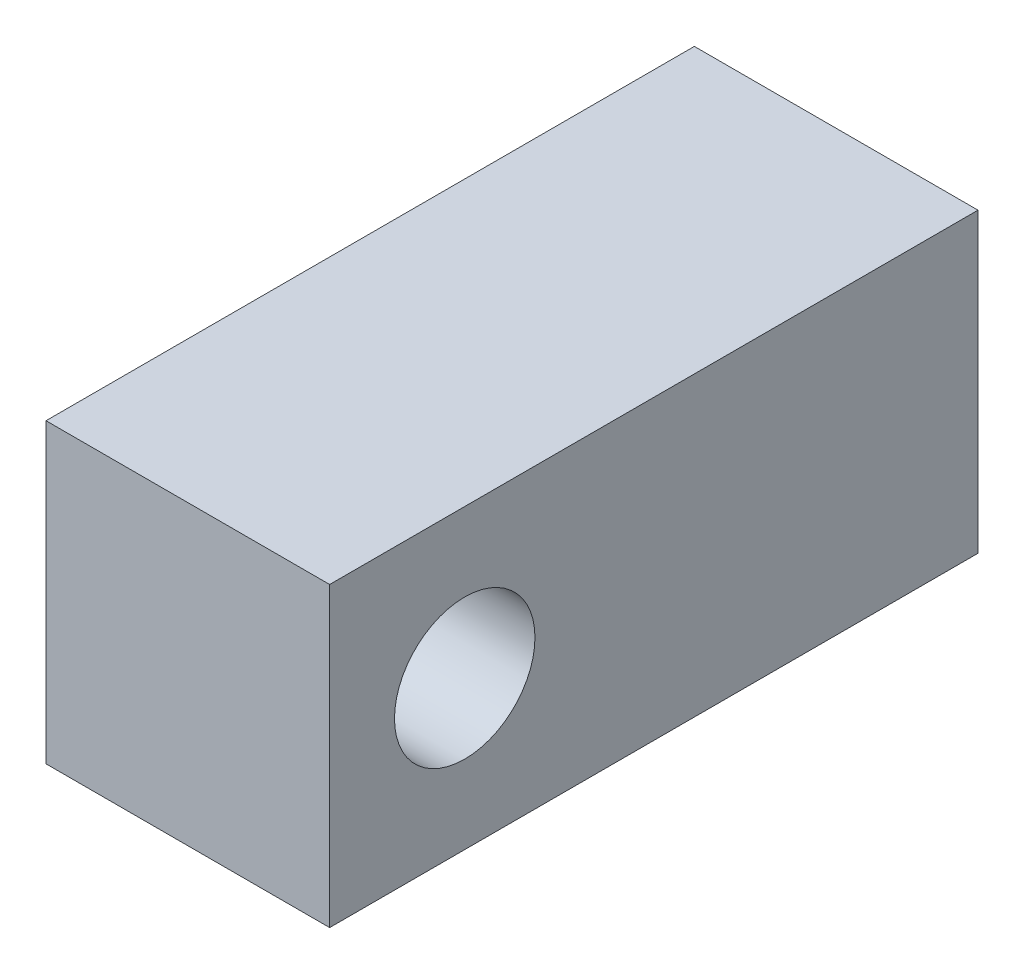
ISO-10303-21;
HEADER;
FILE_DESCRIPTION(('STEP AP214'),'2;1');
FILE_NAME('part.step','',(''),(''),'','','');
FILE_SCHEMA(('AUTOMOTIVE_DESIGN { 1 0 10303 214 1 1 1 1 }'));
ENDSEC;
DATA;
#1=APPLICATION_CONTEXT('core data for automotive mechanical design processes');
#2=APPLICATION_PROTOCOL_DEFINITION('international standard','automotive_design',2000,#1);
#3=PRODUCT_CONTEXT('',#1,'mechanical');
#4=PRODUCT('Part','Part','',(#3));
#5=PRODUCT_RELATED_PRODUCT_CATEGORY('part','',(#4));
#6=PRODUCT_DEFINITION_FORMATION('','',#4);
#7=PRODUCT_DEFINITION_CONTEXT('part definition',#1,'design');
#8=PRODUCT_DEFINITION('design','',#6,#7);
#9=PRODUCT_DEFINITION_SHAPE('','',#8);
#10=(LENGTH_UNIT() NAMED_UNIT(*) SI_UNIT(.MILLI.,.METRE.));
#11=(NAMED_UNIT(*) PLANE_ANGLE_UNIT() SI_UNIT($,.RADIAN.));
#12=(NAMED_UNIT(*) SI_UNIT($,.STERADIAN.) SOLID_ANGLE_UNIT());
#13=UNCERTAINTY_MEASURE_WITH_UNIT(LENGTH_MEASURE(1.E-05),#10,'distance_accuracy_value','');
#14=(GEOMETRIC_REPRESENTATION_CONTEXT(3) GLOBAL_UNCERTAINTY_ASSIGNED_CONTEXT((#13)) GLOBAL_UNIT_ASSIGNED_CONTEXT((#10,
#11,#12)) REPRESENTATION_CONTEXT('',''));
#15=CARTESIAN_POINT('',(0.,0.,0.));
#16=DIRECTION('',(0.,0.,1.));
#17=DIRECTION('',(1.,0.,0.));
#18=AXIS2_PLACEMENT_3D('',#15,#16,#17);
#19=CARTESIAN_POINT('',(37.1122382547684,65.0424365132959,14.9999998733401));
#20=DIRECTION('',(-1.,0.,0.));
#21=DIRECTION('',(0.,0.,-1.));
#22=AXIS2_PLACEMENT_3D('',#19,#20,#21);
#23=PLANE('',#22);
#24=DIRECTION('',(0.,-1.,0.));
#25=VECTOR('',#24,1.);
#26=CARTESIAN_POINT('',(37.1122382547684,71.2424366027028,39.7000002384186));
#27=LINE('',#26,#25);
#28=CARTESIAN_POINT('',(37.1122382547684,71.2424366027028,39.7000002384186));
#29=VERTEX_POINT('',#28);
#30=CARTESIAN_POINT('',(37.1122382547684,58.8424364238889,39.7000002384186));
#31=VERTEX_POINT('',#30);
#32=EDGE_CURVE('E152',#29,#31,#27,.T.);
#33=ORIENTED_EDGE('',*,*,#32,.T.);
#34=DIRECTION('',(0.,0.,-1.));
#35=VECTOR('',#34,1.);
#36=CARTESIAN_POINT('',(37.1122382547684,58.8424364238889,39.7000002384186));
#37=LINE('',#36,#35);
#38=CARTESIAN_POINT('',(37.1122382547684,58.8424364238889,17.299999910593));
#39=VERTEX_POINT('',#38);
#40=EDGE_CURVE('E129',#31,#39,#37,.T.);
#41=ORIENTED_EDGE('',*,*,#40,.T.);
#42=DIRECTION('',(0.,1.,0.));
#43=VECTOR('',#42,1.);
#44=CARTESIAN_POINT('',(37.1122382547684,71.2424366027028,17.299999910593));
#45=LINE('',#44,#43);
#46=CARTESIAN_POINT('',(37.1122382547684,71.2424366027028,17.299999910593));
#47=VERTEX_POINT('',#46);
#48=EDGE_CURVE('E155',#39,#47,#45,.T.);
#49=ORIENTED_EDGE('',*,*,#48,.T.);
#50=DIRECTION('',(0.,0.,1.));
#51=VECTOR('',#50,1.);
#52=CARTESIAN_POINT('',(37.1122382547684,71.2424366027028,39.7000002384186));
#53=LINE('',#52,#51);
#54=EDGE_CURVE('E140',#47,#29,#53,.T.);
#55=ORIENTED_EDGE('',*,*,#54,.T.);
#56=EDGE_LOOP('',(#33,#41,#49,#55));
#57=FACE_BOUND('',#56,.T.);
#58=CARTESIAN_POINT('',(37.1122382547684,65.0424365132959,50.5));
#59=DIRECTION('',(1.,0.,0.));
#60=DIRECTION('',(0.,-1.,0.));
#61=AXIS2_PLACEMENT_3D('',#58,#59,#60);
#62=CIRCLE('',#61,5.2);
#63=CARTESIAN_POINT('',(37.1122382547684,59.8424365132959,50.5));
#64=VERTEX_POINT('',#63);
#65=EDGE_CURVE('E170',#64,#64,#62,.T.);
#66=ORIENTED_EDGE('',*,*,#65,.T.);
#67=EDGE_LOOP('',(#66));
#68=FACE_BOUND('',#67,.T.);
#69=CARTESIAN_POINT('',(37.1122382547684,65.0424365132959,14.4999998360872));
#70=DIRECTION('',(1.,0.,0.));
#71=DIRECTION('',(0.,-1.,0.));
#72=AXIS2_PLACEMENT_3D('',#69,#70,#71);
#73=CIRCLE('',#72,0.999999999999964);
#74=CARTESIAN_POINT('',(37.1122382547684,64.0424365132959,14.4999998360872));
#75=VERTEX_POINT('',#74);
#76=EDGE_CURVE('E177',#75,#75,#73,.T.);
#77=ORIENTED_EDGE('',*,*,#76,.T.);
#78=EDGE_LOOP('',(#77));
#79=FACE_BOUND('',#78,.T.);
#80=CARTESIAN_POINT('',(37.1122382547684,65.0424365132959,42.5000003129244));
#81=DIRECTION('',(1.,0.,0.));
#82=DIRECTION('',(0.,-1.,0.));
#83=AXIS2_PLACEMENT_3D('',#80,#81,#82);
#84=CIRCLE('',#83,0.999999999999968);
#85=CARTESIAN_POINT('',(37.1122382547684,64.0424365132959,42.5000003129244));
#86=VERTEX_POINT('',#85);
#87=EDGE_CURVE('E176',#86,#86,#84,.T.);
#88=ORIENTED_EDGE('',*,*,#87,.T.);
#89=EDGE_LOOP('',(#88));
#90=FACE_BOUND('',#89,.T.);
#91=DIRECTION('',(0.,0.,-1.));
#92=VECTOR('',#91,1.);
#93=CARTESIAN_POINT('',(37.1122382547684,76.0424365132959,60.5));
#94=LINE('',#93,#92);
#95=CARTESIAN_POINT('',(37.1122382547684,76.0424365132959,60.5));
#96=VERTEX_POINT('',#95);
#97=CARTESIAN_POINT('',(37.1122382547684,76.0424365132959,12.5000000745058));
#98=VERTEX_POINT('',#97);
#99=EDGE_CURVE('E222',#96,#98,#94,.T.);
#100=ORIENTED_EDGE('',*,*,#99,.T.);
#101=DIRECTION('',(0.,-1.,0.));
#102=VECTOR('',#101,1.);
#103=CARTESIAN_POINT('',(37.1122382547684,76.0424365132959,12.5000000745058));
#104=LINE('',#103,#102);
#105=CARTESIAN_POINT('',(37.1122382547684,54.0424365132959,12.5000000745058));
#106=VERTEX_POINT('',#105);
#107=EDGE_CURVE('E218',#98,#106,#104,.T.);
#108=ORIENTED_EDGE('',*,*,#107,.T.);
#109=DIRECTION('',(0.,0.,1.));
#110=VECTOR('',#109,1.);
#111=CARTESIAN_POINT('',(37.1122382547684,54.0424365132959,12.5000000745058));
#112=LINE('',#111,#110);
#113=CARTESIAN_POINT('',(37.1122382547684,54.0424365132959,60.5));
#114=VERTEX_POINT('',#113);
#115=EDGE_CURVE('E230',#106,#114,#112,.T.);
#116=ORIENTED_EDGE('',*,*,#115,.T.);
#117=DIRECTION('',(0.,1.,0.));
#118=VECTOR('',#117,1.);
#119=CARTESIAN_POINT('',(37.1122382547684,54.0424365132959,60.5));
#120=LINE('',#119,#118);
#121=EDGE_CURVE('E226',#114,#96,#120,.T.);
#122=ORIENTED_EDGE('',*,*,#121,.T.);
#123=EDGE_LOOP('',(#100,#108,#116,#122));
#124=FACE_BOUND('',#123,.T.);
#125=ADVANCED_FACE('F35',(#57,#68,#79,#90,#124),#23,.T.);
#126=CARTESIAN_POINT('',(-15.6892768072773,76.0424365132959,12.5000000745058));
#127=DIRECTION('',(0.,0.,-1.));
#128=DIRECTION('',(1.,0.,0.));
#129=AXIS2_PLACEMENT_3D('',#126,#127,#128);
#130=PLANE('',#129);
#131=DIRECTION('',(0.,1.,0.));
#132=VECTOR('',#131,1.);
#133=CARTESIAN_POINT('',(54.1122382547684,71.0424365132959,12.5000000745058));
#134=LINE('',#133,#132);
#135=CARTESIAN_POINT('',(54.1122382547684,59.0424365132959,12.5000000745058));
#136=VERTEX_POINT('',#135);
#137=CARTESIAN_POINT('',(54.1122382547684,71.0424365132959,12.5000000745058));
#138=VERTEX_POINT('',#137);
#139=EDGE_CURVE('E184',#136,#138,#134,.T.);
#140=ORIENTED_EDGE('',*,*,#139,.T.);
#141=DIRECTION('',(-1.,0.,0.));
#142=VECTOR('',#141,1.);
#143=CARTESIAN_POINT('',(54.1122382547684,71.0424365132959,12.5000000745058));
#144=LINE('',#143,#142);
#145=CARTESIAN_POINT('',(44.1122382547684,71.0424365132959,12.5000000745058));
#146=VERTEX_POINT('',#145);
#147=EDGE_CURVE('E191',#138,#146,#144,.T.);
#148=ORIENTED_EDGE('',*,*,#147,.T.);
#149=DIRECTION('',(0.,-1.,0.));
#150=VECTOR('',#149,1.);
#151=CARTESIAN_POINT('',(44.1122382547684,71.0424365132959,12.5000000745058));
#152=LINE('',#151,#150);
#153=CARTESIAN_POINT('',(44.1122382547684,59.0424365132959,12.5000000745058));
#154=VERTEX_POINT('',#153);
#155=EDGE_CURVE('E194',#146,#154,#152,.T.);
#156=ORIENTED_EDGE('',*,*,#155,.T.);
#157=DIRECTION('',(1.,0.,0.));
#158=VECTOR('',#157,1.);
#159=CARTESIAN_POINT('',(54.1122382547684,59.0424365132959,12.5000000745058));
#160=LINE('',#159,#158);
#161=EDGE_CURVE('E197',#154,#136,#160,.T.);
#162=ORIENTED_EDGE('',*,*,#161,.T.);
#163=EDGE_LOOP('',(#140,#148,#156,#162));
#164=FACE_BOUND('',#163,.T.);
#165=DIRECTION('',(1.,0.,0.));
#166=VECTOR('',#165,1.);
#167=CARTESIAN_POINT('',(-15.6892768072773,76.0424365132959,12.5000000745058));
#168=LINE('',#167,#166);
#169=CARTESIAN_POINT('',(58.1122382547684,76.0424365132959,12.5000000745058));
#170=VERTEX_POINT('',#169);
#171=EDGE_CURVE('E42',#98,#170,#168,.T.);
#172=ORIENTED_EDGE('',*,*,#171,.T.);
#173=DIRECTION('',(0.,-1.,0.));
#174=VECTOR('',#173,1.);
#175=CARTESIAN_POINT('',(58.1122382547684,76.0424365132959,12.5000000745058));
#176=LINE('',#175,#174);
#177=CARTESIAN_POINT('',(58.1122382547684,54.0424365132959,12.5000000745058));
#178=VERTEX_POINT('',#177);
#179=EDGE_CURVE('E209',#170,#178,#176,.T.);
#180=ORIENTED_EDGE('',*,*,#179,.T.);
#181=DIRECTION('',(1.,0.,0.));
#182=VECTOR('',#181,1.);
#183=CARTESIAN_POINT('',(-15.6892768072773,54.0424365132958,12.5000000745058));
#184=LINE('',#183,#182);
#185=EDGE_CURVE('E221',#106,#178,#184,.T.);
#186=ORIENTED_EDGE('',*,*,#185,.F.);
#187=ORIENTED_EDGE('',*,*,#107,.F.);
#188=EDGE_LOOP('',(#172,#180,#186,#187));
#189=FACE_BOUND('',#188,.T.);
#190=ADVANCED_FACE('F241',(#164,#189),#130,.T.);
#191=CARTESIAN_POINT('',(-15.6892768072773,54.0424365132958,12.5000000745058));
#192=DIRECTION('',(0.,-1.,0.));
#193=DIRECTION('',(1.,0.,0.));
#194=AXIS2_PLACEMENT_3D('',#191,#192,#193);
#195=PLANE('',#194);
#196=ORIENTED_EDGE('',*,*,#185,.T.);
#197=DIRECTION('',(0.,0.,1.));
#198=VECTOR('',#197,1.);
#199=CARTESIAN_POINT('',(58.1122382547684,54.0424365132959,12.5000000745058));
#200=LINE('',#199,#198);
#201=CARTESIAN_POINT('',(58.1122382547684,54.0424365132959,60.5));
#202=VERTEX_POINT('',#201);
#203=EDGE_CURVE('E212',#178,#202,#200,.T.);
#204=ORIENTED_EDGE('',*,*,#203,.T.);
#205=DIRECTION('',(1.,0.,0.));
#206=VECTOR('',#205,1.);
#207=CARTESIAN_POINT('',(-15.6892768072773,54.0424365132958,60.5));
#208=LINE('',#207,#206);
#209=EDGE_CURVE('E229',#114,#202,#208,.T.);
#210=ORIENTED_EDGE('',*,*,#209,.F.);
#211=ORIENTED_EDGE('',*,*,#115,.F.);
#212=EDGE_LOOP('',(#196,#204,#210,#211));
#213=FACE_BOUND('',#212,.T.);
#214=ADVANCED_FACE('F250',(#213),#195,.T.);
#215=CARTESIAN_POINT('',(-15.6892768072773,54.0424365132958,60.5));
#216=DIRECTION('',(0.,0.,1.));
#217=DIRECTION('',(-1.,0.,0.));
#218=AXIS2_PLACEMENT_3D('',#215,#216,#217);
#219=PLANE('',#218);
#220=ORIENTED_EDGE('',*,*,#209,.T.);
#221=DIRECTION('',(0.,1.,0.));
#222=VECTOR('',#221,1.);
#223=CARTESIAN_POINT('',(58.1122382547684,54.0424365132959,60.5));
#224=LINE('',#223,#222);
#225=CARTESIAN_POINT('',(58.1122382547684,76.0424365132959,60.5));
#226=VERTEX_POINT('',#225);
#227=EDGE_CURVE('E215',#202,#226,#224,.T.);
#228=ORIENTED_EDGE('',*,*,#227,.T.);
#229=DIRECTION('',(1.,0.,0.));
#230=VECTOR('',#229,1.);
#231=CARTESIAN_POINT('',(-15.6892768072773,76.0424365132959,60.5));
#232=LINE('',#231,#230);
#233=EDGE_CURVE('E225',#96,#226,#232,.T.);
#234=ORIENTED_EDGE('',*,*,#233,.F.);
#235=ORIENTED_EDGE('',*,*,#121,.F.);
#236=EDGE_LOOP('',(#220,#228,#234,#235));
#237=FACE_BOUND('',#236,.T.);
#238=ADVANCED_FACE('F254',(#237),#219,.T.);
#239=CARTESIAN_POINT('',(-15.6892768072773,76.0424365132959,60.5));
#240=DIRECTION('',(0.,1.,0.));
#241=DIRECTION('',(-1.,0.,0.));
#242=AXIS2_PLACEMENT_3D('',#239,#240,#241);
#243=PLANE('',#242);
#244=ORIENTED_EDGE('',*,*,#233,.T.);
#245=DIRECTION('',(0.,0.,-1.));
#246=VECTOR('',#245,1.);
#247=CARTESIAN_POINT('',(58.1122382547684,76.0424365132959,60.5));
#248=LINE('',#247,#246);
#249=EDGE_CURVE('E202',#226,#170,#248,.T.);
#250=ORIENTED_EDGE('',*,*,#249,.T.);
#251=ORIENTED_EDGE('',*,*,#171,.F.);
#252=ORIENTED_EDGE('',*,*,#99,.F.);
#253=EDGE_LOOP('',(#244,#250,#251,#252));
#254=FACE_BOUND('',#253,.T.);
#255=ADVANCED_FACE('F245',(#254),#243,.T.);
#256=CARTESIAN_POINT('',(58.1122382547684,0.,0.));
#257=DIRECTION('',(1.,0.,0.));
#258=DIRECTION('',(0.,1.,0.));
#259=AXIS2_PLACEMENT_3D('',#256,#257,#258);
#260=PLANE('',#259);
#261=CARTESIAN_POINT('',(58.1122382547684,65.0424365132959,50.5));
#262=DIRECTION('',(-1.,0.,0.));
#263=DIRECTION('',(0.,1.,0.));
#264=AXIS2_PLACEMENT_3D('',#261,#262,#263);
#265=CIRCLE('',#264,5.2);
#266=CARTESIAN_POINT('',(58.1122382547684,70.2424365132959,50.5));
#267=VERTEX_POINT('',#266);
#268=EDGE_CURVE('E173',#267,#267,#265,.F.);
#269=ORIENTED_EDGE('',*,*,#268,.F.);
#270=EDGE_LOOP('',(#269));
#271=FACE_BOUND('',#270,.T.);
#272=ORIENTED_EDGE('',*,*,#249,.F.);
#273=ORIENTED_EDGE('',*,*,#227,.F.);
#274=ORIENTED_EDGE('',*,*,#203,.F.);
#275=ORIENTED_EDGE('',*,*,#179,.F.);
#276=EDGE_LOOP('',(#272,#273,#274,#275));
#277=FACE_BOUND('',#276,.T.);
#278=ADVANCED_FACE('F247',(#271,#277),#260,.T.);
#279=CARTESIAN_POINT('',(54.1122382547684,71.0424365132959,17.5000000745058));
#280=DIRECTION('',(1.,0.,0.));
#281=DIRECTION('',(0.,0.,1.));
#282=AXIS2_PLACEMENT_3D('',#279,#280,#281);
#283=PLANE('',#282);
#284=DIRECTION('',(0.,0.,-1.));
#285=VECTOR('',#284,1.);
#286=CARTESIAN_POINT('',(54.1122382547684,71.0424365132959,17.5000000745058));
#287=LINE('',#286,#285);
#288=CARTESIAN_POINT('',(54.1122382547684,71.0424365132959,17.299999910593));
#289=VERTEX_POINT('',#288);
#290=EDGE_CURVE('E57',#289,#138,#287,.T.);
#291=ORIENTED_EDGE('',*,*,#290,.T.);
#292=ORIENTED_EDGE('',*,*,#139,.F.);
#293=DIRECTION('',(0.,0.,-1.));
#294=VECTOR('',#293,1.);
#295=CARTESIAN_POINT('',(54.1122382547684,59.0424365132959,17.5000000745058));
#296=LINE('',#295,#294);
#297=CARTESIAN_POINT('',(54.1122382547684,59.0424365132959,17.299999910593));
#298=VERTEX_POINT('',#297);
#299=EDGE_CURVE('E200',#298,#136,#296,.T.);
#300=ORIENTED_EDGE('',*,*,#299,.F.);
#301=DIRECTION('',(0.,1.,0.));
#302=VECTOR('',#301,1.);
#303=CARTESIAN_POINT('',(54.1122382547684,71.2424366027028,17.299999910593));
#304=LINE('',#303,#302);
#305=CARTESIAN_POINT('',(54.1122382547684,58.8424364238889,17.299999910593));
#306=VERTEX_POINT('',#305);
#307=EDGE_CURVE('E145',#306,#298,#304,.T.);
#308=ORIENTED_EDGE('',*,*,#307,.F.);
#309=DIRECTION('',(0.,0.,-1.));
#310=VECTOR('',#309,1.);
#311=CARTESIAN_POINT('',(54.1122382547684,58.8424364238889,39.7000002384186));
#312=LINE('',#311,#310);
#313=CARTESIAN_POINT('',(54.1122382547684,58.8424364238889,39.7000002384186));
#314=VERTEX_POINT('',#313);
#315=EDGE_CURVE('E126',#314,#306,#312,.T.);
#316=ORIENTED_EDGE('',*,*,#315,.F.);
#317=DIRECTION('',(0.,-1.,0.));
#318=VECTOR('',#317,1.);
#319=CARTESIAN_POINT('',(54.1122382547684,71.2424366027028,39.7000002384186));
#320=LINE('',#319,#318);
#321=CARTESIAN_POINT('',(54.1122382547684,71.2424366027028,39.7000002384186));
#322=VERTEX_POINT('',#321);
#323=EDGE_CURVE('E135',#322,#314,#320,.T.);
#324=ORIENTED_EDGE('',*,*,#323,.F.);
#325=DIRECTION('',(0.,0.,1.));
#326=VECTOR('',#325,1.);
#327=CARTESIAN_POINT('',(54.1122382547684,71.2424366027028,39.7000002384186));
#328=LINE('',#327,#326);
#329=CARTESIAN_POINT('',(54.1122382547684,71.2424366027028,17.299999910593));
#330=VERTEX_POINT('',#329);
#331=EDGE_CURVE('E132',#330,#322,#328,.T.);
#332=ORIENTED_EDGE('',*,*,#331,.F.);
#333=EDGE_CURVE('E146',#289,#330,#304,.T.);
#334=ORIENTED_EDGE('',*,*,#333,.F.);
#335=EDGE_LOOP('',(#291,#292,#300,#308,#316,#324,#332,#334));
#336=FACE_BOUND('',#335,.T.);
#337=ADVANCED_FACE('F142',(#336),#283,.F.);
#338=CARTESIAN_POINT('',(54.1122382547684,59.0424365132959,17.5000000745058));
#339=DIRECTION('',(0.,-1.,0.));
#340=DIRECTION('',(0.,0.,1.));
#341=AXIS2_PLACEMENT_3D('',#338,#339,#340);
#342=PLANE('',#341);
#343=ORIENTED_EDGE('',*,*,#299,.T.);
#344=ORIENTED_EDGE('',*,*,#161,.F.);
#345=DIRECTION('',(0.,0.,-1.));
#346=VECTOR('',#345,1.);
#347=CARTESIAN_POINT('',(44.1122382547684,59.0424365132959,17.5000000745058));
#348=LINE('',#347,#346);
#349=CARTESIAN_POINT('',(44.1122382547684,59.0424365132959,17.299999910593));
#350=VERTEX_POINT('',#349);
#351=EDGE_CURVE('E203',#350,#154,#348,.T.);
#352=ORIENTED_EDGE('',*,*,#351,.F.);
#353=DIRECTION('',(-1.,0.,0.));
#354=VECTOR('',#353,1.);
#355=CARTESIAN_POINT('',(54.1122382547684,59.0424365132959,17.299999910593));
#356=LINE('',#355,#354);
#357=EDGE_CURVE('E167',#298,#350,#356,.T.);
#358=ORIENTED_EDGE('',*,*,#357,.F.);
#359=EDGE_LOOP('',(#343,#344,#352,#358));
#360=FACE_BOUND('',#359,.T.);
#361=ADVANCED_FACE('F294',(#360),#342,.F.);
#362=CARTESIAN_POINT('',(44.1122382547684,71.0424365132959,17.5000000745058));
#363=DIRECTION('',(-1.,0.,0.));
#364=DIRECTION('',(0.,0.,-1.));
#365=AXIS2_PLACEMENT_3D('',#362,#363,#364);
#366=PLANE('',#365);
#367=CARTESIAN_POINT('',(44.1122382547684,65.0424365132959,14.4999998360872));
#368=DIRECTION('',(1.,0.,0.));
#369=DIRECTION('',(0.,0.,-1.));
#370=AXIS2_PLACEMENT_3D('',#367,#368,#369);
#371=CIRCLE('',#370,0.999999999999964);
#372=CARTESIAN_POINT('',(44.1122382547684,64.0424365132959,14.4999998360872));
#373=VERTEX_POINT('',#372);
#374=EDGE_CURVE('E180',#373,#373,#371,.F.);
#375=ORIENTED_EDGE('',*,*,#374,.T.);
#376=EDGE_LOOP('',(#375));
#377=FACE_BOUND('',#376,.T.);
#378=ORIENTED_EDGE('',*,*,#351,.T.);
#379=ORIENTED_EDGE('',*,*,#155,.F.);
#380=DIRECTION('',(0.,0.,-1.));
#381=VECTOR('',#380,1.);
#382=CARTESIAN_POINT('',(44.1122382547684,71.0424365132959,17.5000000745058));
#383=LINE('',#382,#381);
#384=CARTESIAN_POINT('',(44.1122382547684,71.0424365132959,17.299999910593));
#385=VERTEX_POINT('',#384);
#386=EDGE_CURVE('E205',#385,#146,#383,.T.);
#387=ORIENTED_EDGE('',*,*,#386,.F.);
#388=DIRECTION('',(0.,1.,0.));
#389=VECTOR('',#388,1.);
#390=CARTESIAN_POINT('',(44.1122382547684,71.0424365132959,17.299999910593));
#391=LINE('',#390,#389);
#392=EDGE_CURVE('E161',#350,#385,#391,.T.);
#393=ORIENTED_EDGE('',*,*,#392,.F.);
#394=EDGE_LOOP('',(#378,#379,#387,#393));
#395=FACE_BOUND('',#394,.T.);
#396=ADVANCED_FACE('F297',(#377,#395),#366,.F.);
#397=CARTESIAN_POINT('',(54.1122382547684,71.0424365132959,17.5000000745058));
#398=DIRECTION('',(0.,1.,0.));
#399=DIRECTION('',(0.,0.,-1.));
#400=AXIS2_PLACEMENT_3D('',#397,#398,#399);
#401=PLANE('',#400);
#402=ORIENTED_EDGE('',*,*,#386,.T.);
#403=ORIENTED_EDGE('',*,*,#147,.F.);
#404=ORIENTED_EDGE('',*,*,#290,.F.);
#405=DIRECTION('',(1.,0.,0.));
#406=VECTOR('',#405,1.);
#407=CARTESIAN_POINT('',(54.1122382547684,71.0424365132959,17.299999910593));
#408=LINE('',#407,#406);
#409=EDGE_CURVE('E11',#385,#289,#408,.T.);
#410=ORIENTED_EDGE('',*,*,#409,.F.);
#411=EDGE_LOOP('',(#402,#403,#404,#410));
#412=FACE_BOUND('',#411,.T.);
#413=ADVANCED_FACE('F289',(#412),#401,.F.);
#414=CARTESIAN_POINT('',(46.9406653795145,65.0424365132959,14.4999998360872));
#415=DIRECTION('',(-1.,0.,0.));
#416=DIRECTION('',(0.,-1.,0.));
#417=AXIS2_PLACEMENT_3D('',#414,#415,#416);
#418=CYLINDRICAL_SURFACE('',#417,0.999999999999964);
#419=CARTESIAN_POINT('',(44.1122382547684,64.0424365132959,14.4999998360872));
#420=CARTESIAN_POINT('',(44.0393215881017,64.0424365132959,14.4999998360872));
#421=CARTESIAN_POINT('',(43.9664049214351,64.0424365132959,14.4999998360872));
#422=CARTESIAN_POINT('',(43.8205715881017,64.0424365132959,14.4999998360872));
#423=CARTESIAN_POINT('',(43.7476549214351,64.0424365132959,14.4999998360872));
#424=CARTESIAN_POINT('',(43.6018215881017,64.0424365132959,14.4999998360872));
#425=CARTESIAN_POINT('',(43.5289049214351,64.0424365132959,14.4999998360872));
#426=CARTESIAN_POINT('',(43.3830715881017,64.0424365132959,14.4999998360872));
#427=CARTESIAN_POINT('',(43.3101549214351,64.0424365132959,14.4999998360872));
#428=CARTESIAN_POINT('',(43.1643215881017,64.0424365132959,14.4999998360872));
#429=CARTESIAN_POINT('',(43.0914049214351,64.0424365132959,14.4999998360872));
#430=CARTESIAN_POINT('',(42.9455715881017,64.0424365132959,14.4999998360872));
#431=CARTESIAN_POINT('',(42.8726549214351,64.0424365132959,14.4999998360872));
#432=CARTESIAN_POINT('',(42.7268215881017,64.0424365132959,14.4999998360872));
#433=CARTESIAN_POINT('',(42.6539049214351,64.0424365132959,14.4999998360872));
#434=CARTESIAN_POINT('',(42.5080715881017,64.0424365132959,14.4999998360872));
#435=CARTESIAN_POINT('',(42.4351549214351,64.0424365132959,14.4999998360872));
#436=CARTESIAN_POINT('',(42.2893215881017,64.0424365132959,14.4999998360872));
#437=CARTESIAN_POINT('',(42.2164049214351,64.0424365132959,14.4999998360872));
#438=CARTESIAN_POINT('',(42.0705715881017,64.0424365132959,14.4999998360872));
#439=CARTESIAN_POINT('',(41.9976549214351,64.0424365132959,14.4999998360872));
#440=CARTESIAN_POINT('',(41.8518215881017,64.0424365132959,14.4999998360872));
#441=CARTESIAN_POINT('',(41.7789049214351,64.0424365132959,14.4999998360872));
#442=CARTESIAN_POINT('',(41.6330715881017,64.0424365132959,14.4999998360872));
#443=CARTESIAN_POINT('',(41.5601549214351,64.0424365132959,14.4999998360872));
#444=CARTESIAN_POINT('',(41.4143215881017,64.0424365132959,14.4999998360872));
#445=CARTESIAN_POINT('',(41.3414049214351,64.0424365132959,14.4999998360872));
#446=CARTESIAN_POINT('',(41.1955715881017,64.0424365132959,14.4999998360872));
#447=CARTESIAN_POINT('',(41.1226549214351,64.0424365132959,14.4999998360872));
#448=CARTESIAN_POINT('',(40.9768215881017,64.0424365132959,14.4999998360872));
#449=CARTESIAN_POINT('',(40.9039049214351,64.0424365132959,14.4999998360872));
#450=CARTESIAN_POINT('',(40.7580715881017,64.0424365132959,14.4999998360872));
#451=CARTESIAN_POINT('',(40.6851549214351,64.0424365132959,14.4999998360872));
#452=CARTESIAN_POINT('',(40.5393215881017,64.0424365132959,14.4999998360872));
#453=CARTESIAN_POINT('',(40.4664049214351,64.0424365132959,14.4999998360872));
#454=CARTESIAN_POINT('',(40.3205715881017,64.0424365132959,14.4999998360872));
#455=CARTESIAN_POINT('',(40.2476549214351,64.0424365132959,14.4999998360872));
#456=CARTESIAN_POINT('',(40.1018215881017,64.0424365132959,14.4999998360872));
#457=CARTESIAN_POINT('',(40.0289049214351,64.0424365132959,14.4999998360872));
#458=CARTESIAN_POINT('',(39.8830715881017,64.0424365132959,14.4999998360872));
#459=CARTESIAN_POINT('',(39.8101549214351,64.0424365132959,14.4999998360872));
#460=CARTESIAN_POINT('',(39.6643215881017,64.0424365132959,14.4999998360872));
#461=CARTESIAN_POINT('',(39.5914049214351,64.0424365132959,14.4999998360872));
#462=CARTESIAN_POINT('',(39.4455715881017,64.0424365132959,14.4999998360872));
#463=CARTESIAN_POINT('',(39.3726549214351,64.0424365132959,14.4999998360872));
#464=CARTESIAN_POINT('',(39.2268215881017,64.0424365132959,14.4999998360872));
#465=CARTESIAN_POINT('',(39.1539049214351,64.0424365132959,14.4999998360872));
#466=CARTESIAN_POINT('',(39.0080715881017,64.0424365132959,14.4999998360872));
#467=CARTESIAN_POINT('',(38.9351549214351,64.0424365132959,14.4999998360872));
#468=CARTESIAN_POINT('',(38.7893215881017,64.0424365132959,14.4999998360872));
#469=CARTESIAN_POINT('',(38.7164049214351,64.0424365132959,14.4999998360872));
#470=CARTESIAN_POINT('',(38.5705715881017,64.0424365132959,14.4999998360872));
#471=CARTESIAN_POINT('',(38.4976549214351,64.0424365132959,14.4999998360872));
#472=CARTESIAN_POINT('',(38.3518215881017,64.0424365132959,14.4999998360872));
#473=CARTESIAN_POINT('',(38.2789049214351,64.0424365132959,14.4999998360872));
#474=CARTESIAN_POINT('',(38.1330715881017,64.0424365132959,14.4999998360872));
#475=CARTESIAN_POINT('',(38.0601549214351,64.0424365132959,14.4999998360872));
#476=CARTESIAN_POINT('',(37.9143215881017,64.0424365132959,14.4999998360872));
#477=CARTESIAN_POINT('',(37.8414049214351,64.0424365132959,14.4999998360872));
#478=CARTESIAN_POINT('',(37.6955715881017,64.0424365132959,14.4999998360872));
#479=CARTESIAN_POINT('',(37.6226549214351,64.0424365132959,14.4999998360872));
#480=CARTESIAN_POINT('',(37.4768215881017,64.0424365132959,14.4999998360872));
#481=CARTESIAN_POINT('',(37.4039049214351,64.0424365132959,14.4999998360872));
#482=CARTESIAN_POINT('',(37.2580715881017,64.0424365132959,14.4999998360872));
#483=CARTESIAN_POINT('',(37.1851549214351,64.0424365132959,14.4999998360872));
#484=CARTESIAN_POINT('',(37.1122382547684,64.0424365132959,14.4999998360872));
#485=B_SPLINE_CURVE_WITH_KNOTS('',3,(#419,#420,#421,#422,#423,#424,#425,#426,#427,#428,#429,
#430,#431,#432,#433,#434,#435,#436,#437,#438,#439,#440,#441,#442,#443,#444,#445,#446,#447,#448,
#449,#450,#451,#452,#453,#454,#455,#456,#457,#458,#459,#460,#461,#462,#463,#464,#465,#466,#467,
#468,#469,#470,#471,#472,#473,#474,#475,#476,#477,#478,#479,#480,#481,#482,#483,#484),
.UNSPECIFIED.,.F.,.F.,(4,2,2,2,2,2,2,2,2,2,2,2,2,2,2,2,2,2,2,2,2,2,2,2,2,2,2,2,2,2,2,2,4),(0.,
0.218750000000004,0.4375,0.656250000000004,0.875000000000001,1.09375,1.3125,1.53125,1.75,
1.96875,2.1875,2.40625,2.625,2.84375,3.0625,3.28125,3.5,3.71875,3.9375,4.15625,4.375,4.59375,
4.8125,5.03124999999999,5.25,5.46874999999999,5.6875,5.90624999999999,6.125,6.34375,
6.56249999999999,6.78125,6.99999999999999),.UNSPECIFIED.);
#486=EDGE_CURVE('BSEAM279',#373,#75,#485,.T.);
#487=ORIENTED_EDGE('',*,*,#374,.F.);
#488=ORIENTED_EDGE('',*,*,#76,.F.);
#489=ORIENTED_EDGE('',*,*,#486,.T.);
#490=ORIENTED_EDGE('',*,*,#486,.F.);
#491=EDGE_LOOP('',(#487,#489,#488,#490));
#492=FACE_BOUND('',#491,.T.);
#493=ADVANCED_FACE('F279',(#492),#418,.F.);
#494=CARTESIAN_POINT('',(46.9406653795145,65.0424365132959,42.5000003129244));
#495=DIRECTION('',(-1.,0.,0.));
#496=DIRECTION('',(0.,-1.,0.));
#497=AXIS2_PLACEMENT_3D('',#494,#495,#496);
#498=CYLINDRICAL_SURFACE('',#497,0.999999999999968);
#499=CARTESIAN_POINT('',(44.1122382547684,65.0424365132959,42.5000003129244));
#500=DIRECTION('',(1.,0.,0.));
#501=DIRECTION('',(0.,0.,-1.));
#502=AXIS2_PLACEMENT_3D('',#499,#500,#501);
#503=CIRCLE('',#502,0.999999999999968);
#504=CARTESIAN_POINT('',(44.1122382547684,64.0424365132959,42.5000003129244));
#505=VERTEX_POINT('',#504);
#506=EDGE_CURVE('E181',#505,#505,#503,.F.);
#507=CARTESIAN_POINT('',(44.1122382547684,64.0424365132959,42.5000003129244));
#508=CARTESIAN_POINT('',(44.0393215881017,64.0424365132959,42.5000003129244));
#509=CARTESIAN_POINT('',(43.9664049214351,64.0424365132959,42.5000003129244));
#510=CARTESIAN_POINT('',(43.8205715881017,64.0424365132959,42.5000003129244));
#511=CARTESIAN_POINT('',(43.7476549214351,64.0424365132959,42.5000003129244));
#512=CARTESIAN_POINT('',(43.6018215881017,64.0424365132959,42.5000003129244));
#513=CARTESIAN_POINT('',(43.5289049214351,64.0424365132959,42.5000003129244));
#514=CARTESIAN_POINT('',(43.3830715881017,64.0424365132959,42.5000003129244));
#515=CARTESIAN_POINT('',(43.3101549214351,64.0424365132959,42.5000003129244));
#516=CARTESIAN_POINT('',(43.1643215881017,64.0424365132959,42.5000003129244));
#517=CARTESIAN_POINT('',(43.0914049214351,64.0424365132959,42.5000003129244));
#518=CARTESIAN_POINT('',(42.9455715881017,64.0424365132959,42.5000003129244));
#519=CARTESIAN_POINT('',(42.8726549214351,64.0424365132959,42.5000003129244));
#520=CARTESIAN_POINT('',(42.7268215881017,64.0424365132959,42.5000003129244));
#521=CARTESIAN_POINT('',(42.6539049214351,64.0424365132959,42.5000003129244));
#522=CARTESIAN_POINT('',(42.5080715881017,64.0424365132959,42.5000003129244));
#523=CARTESIAN_POINT('',(42.4351549214351,64.0424365132959,42.5000003129244));
#524=CARTESIAN_POINT('',(42.2893215881017,64.0424365132959,42.5000003129244));
#525=CARTESIAN_POINT('',(42.2164049214351,64.0424365132959,42.5000003129244));
#526=CARTESIAN_POINT('',(42.0705715881017,64.0424365132959,42.5000003129244));
#527=CARTESIAN_POINT('',(41.9976549214351,64.0424365132959,42.5000003129244));
#528=CARTESIAN_POINT('',(41.8518215881017,64.0424365132959,42.5000003129244));
#529=CARTESIAN_POINT('',(41.7789049214351,64.0424365132959,42.5000003129244));
#530=CARTESIAN_POINT('',(41.6330715881017,64.0424365132959,42.5000003129244));
#531=CARTESIAN_POINT('',(41.5601549214351,64.0424365132959,42.5000003129244));
#532=CARTESIAN_POINT('',(41.4143215881017,64.0424365132959,42.5000003129244));
#533=CARTESIAN_POINT('',(41.3414049214351,64.0424365132959,42.5000003129244));
#534=CARTESIAN_POINT('',(41.1955715881017,64.0424365132959,42.5000003129244));
#535=CARTESIAN_POINT('',(41.1226549214351,64.0424365132959,42.5000003129244));
#536=CARTESIAN_POINT('',(40.9768215881017,64.0424365132959,42.5000003129244));
#537=CARTESIAN_POINT('',(40.9039049214351,64.0424365132959,42.5000003129244));
#538=CARTESIAN_POINT('',(40.7580715881017,64.0424365132959,42.5000003129244));
#539=CARTESIAN_POINT('',(40.6851549214351,64.0424365132959,42.5000003129244));
#540=CARTESIAN_POINT('',(40.5393215881017,64.0424365132959,42.5000003129244));
#541=CARTESIAN_POINT('',(40.4664049214351,64.0424365132959,42.5000003129244));
#542=CARTESIAN_POINT('',(40.3205715881017,64.0424365132959,42.5000003129244));
#543=CARTESIAN_POINT('',(40.2476549214351,64.0424365132959,42.5000003129244));
#544=CARTESIAN_POINT('',(40.1018215881017,64.0424365132959,42.5000003129244));
#545=CARTESIAN_POINT('',(40.0289049214351,64.0424365132959,42.5000003129244));
#546=CARTESIAN_POINT('',(39.8830715881017,64.0424365132959,42.5000003129244));
#547=CARTESIAN_POINT('',(39.8101549214351,64.0424365132959,42.5000003129244));
#548=CARTESIAN_POINT('',(39.6643215881017,64.0424365132959,42.5000003129244));
#549=CARTESIAN_POINT('',(39.5914049214351,64.0424365132959,42.5000003129244));
#550=CARTESIAN_POINT('',(39.4455715881017,64.0424365132959,42.5000003129244));
#551=CARTESIAN_POINT('',(39.3726549214351,64.0424365132959,42.5000003129244));
#552=CARTESIAN_POINT('',(39.2268215881017,64.0424365132959,42.5000003129244));
#553=CARTESIAN_POINT('',(39.1539049214351,64.0424365132959,42.5000003129244));
#554=CARTESIAN_POINT('',(39.0080715881017,64.0424365132959,42.5000003129244));
#555=CARTESIAN_POINT('',(38.9351549214351,64.0424365132959,42.5000003129244));
#556=CARTESIAN_POINT('',(38.7893215881017,64.0424365132959,42.5000003129244));
#557=CARTESIAN_POINT('',(38.7164049214351,64.0424365132959,42.5000003129244));
#558=CARTESIAN_POINT('',(38.5705715881017,64.0424365132959,42.5000003129244));
#559=CARTESIAN_POINT('',(38.4976549214351,64.0424365132959,42.5000003129244));
#560=CARTESIAN_POINT('',(38.3518215881017,64.0424365132959,42.5000003129244));
#561=CARTESIAN_POINT('',(38.2789049214351,64.0424365132959,42.5000003129244));
#562=CARTESIAN_POINT('',(38.1330715881017,64.0424365132959,42.5000003129244));
#563=CARTESIAN_POINT('',(38.0601549214351,64.0424365132959,42.5000003129244));
#564=CARTESIAN_POINT('',(37.9143215881017,64.0424365132959,42.5000003129244));
#565=CARTESIAN_POINT('',(37.8414049214351,64.0424365132959,42.5000003129244));
#566=CARTESIAN_POINT('',(37.6955715881017,64.0424365132959,42.5000003129244));
#567=CARTESIAN_POINT('',(37.6226549214351,64.0424365132959,42.5000003129244));
#568=CARTESIAN_POINT('',(37.4768215881017,64.0424365132959,42.5000003129244));
#569=CARTESIAN_POINT('',(37.4039049214351,64.0424365132959,42.5000003129244));
#570=CARTESIAN_POINT('',(37.2580715881017,64.0424365132959,42.5000003129244));
#571=CARTESIAN_POINT('',(37.1851549214351,64.0424365132959,42.5000003129244));
#572=CARTESIAN_POINT('',(37.1122382547684,64.0424365132959,42.5000003129244));
#573=B_SPLINE_CURVE_WITH_KNOTS('',3,(#507,#508,#509,#510,#511,#512,#513,#514,#515,#516,#517,
#518,#519,#520,#521,#522,#523,#524,#525,#526,#527,#528,#529,#530,#531,#532,#533,#534,#535,#536,
#537,#538,#539,#540,#541,#542,#543,#544,#545,#546,#547,#548,#549,#550,#551,#552,#553,#554,#555,
#556,#557,#558,#559,#560,#561,#562,#563,#564,#565,#566,#567,#568,#569,#570,#571,#572),
.UNSPECIFIED.,.F.,.F.,(4,2,2,2,2,2,2,2,2,2,2,2,2,2,2,2,2,2,2,2,2,2,2,2,2,2,2,2,2,2,2,2,4),(0.,
0.218750000000004,0.4375,0.656250000000004,0.875000000000001,1.09375,1.3125,1.53125,1.75,
1.96875,2.1875,2.40625,2.625,2.84375,3.0625,3.28125,3.5,3.71875,3.9375,4.15625,4.375,4.59375,
4.8125,5.03124999999999,5.25,5.46874999999999,5.6875,5.90624999999999,6.125,6.34375,
6.56249999999999,6.78125,6.99999999999999),.UNSPECIFIED.);
#574=EDGE_CURVE('BSEAM276',#505,#86,#573,.T.);
#575=ORIENTED_EDGE('',*,*,#506,.F.);
#576=ORIENTED_EDGE('',*,*,#87,.F.);
#577=ORIENTED_EDGE('',*,*,#574,.T.);
#578=ORIENTED_EDGE('',*,*,#574,.F.);
#579=EDGE_LOOP('',(#575,#577,#576,#578));
#580=FACE_BOUND('',#579,.T.);
#581=ADVANCED_FACE('F276',(#580),#498,.F.);
#582=CARTESIAN_POINT('',(44.1122382547684,71.0424365132959,17.5000000745058));
#583=DIRECTION('',(-1.,0.,0.));
#584=DIRECTION('',(0.,0.,-1.));
#585=AXIS2_PLACEMENT_3D('',#582,#583,#584);
#586=PLANE('',#585);
#587=ORIENTED_EDGE('',*,*,#506,.T.);
#588=EDGE_LOOP('',(#587));
#589=FACE_BOUND('',#588,.T.);
#590=ADVANCED_FACE('F278',(#589),#586,.T.);
#591=CARTESIAN_POINT('',(72.8200593034486,65.0424365132959,50.5));
#592=DIRECTION('',(-1.,0.,0.));
#593=DIRECTION('',(0.,-1.,0.));
#594=AXIS2_PLACEMENT_3D('',#591,#592,#593);
#595=CYLINDRICAL_SURFACE('',#594,5.2);
#596=ORIENTED_EDGE('',*,*,#65,.F.);
#597=EDGE_LOOP('',(#596));
#598=FACE_BOUND('',#597,.T.);
#599=ORIENTED_EDGE('',*,*,#268,.T.);
#600=EDGE_LOOP('',(#599));
#601=FACE_BOUND('',#600,.T.);
#602=ADVANCED_FACE('F286',(#598,#601),#595,.F.);
#603=CARTESIAN_POINT('',(54.1122382547684,71.2424366027028,17.299999910593));
#604=DIRECTION('',(0.,0.,-1.));
#605=DIRECTION('',(1.,0.,0.));
#606=AXIS2_PLACEMENT_3D('',#603,#604,#605);
#607=PLANE('',#606);
#608=ORIENTED_EDGE('',*,*,#307,.T.);
#609=ORIENTED_EDGE('',*,*,#357,.T.);
#610=ORIENTED_EDGE('',*,*,#392,.T.);
#611=ORIENTED_EDGE('',*,*,#409,.T.);
#612=ORIENTED_EDGE('',*,*,#333,.T.);
#613=DIRECTION('',(-1.,0.,0.));
#614=VECTOR('',#613,1.);
#615=CARTESIAN_POINT('',(54.1122382547684,71.2424366027028,17.299999910593));
#616=LINE('',#615,#614);
#617=EDGE_CURVE('E162',#330,#47,#616,.T.);
#618=ORIENTED_EDGE('',*,*,#617,.T.);
#619=ORIENTED_EDGE('',*,*,#48,.F.);
#620=DIRECTION('',(-1.,0.,0.));
#621=VECTOR('',#620,1.);
#622=CARTESIAN_POINT('',(54.1122382547684,58.8424364238889,17.299999910593));
#623=LINE('',#622,#621);
#624=EDGE_CURVE('E131',#306,#39,#623,.T.);
#625=ORIENTED_EDGE('',*,*,#624,.F.);
#626=EDGE_LOOP('',(#608,#609,#610,#611,#612,#618,#619,#625));
#627=FACE_BOUND('',#626,.T.);
#628=ADVANCED_FACE('F314',(#627),#607,.F.);
#629=CARTESIAN_POINT('',(54.1122382547684,71.2424366027028,39.7000002384186));
#630=DIRECTION('',(0.,0.,1.));
#631=DIRECTION('',(-1.,0.,0.));
#632=AXIS2_PLACEMENT_3D('',#629,#630,#631);
#633=PLANE('',#632);
#634=ORIENTED_EDGE('',*,*,#32,.F.);
#635=DIRECTION('',(-1.,0.,0.));
#636=VECTOR('',#635,1.);
#637=CARTESIAN_POINT('',(54.1122382547684,71.2424366027028,39.7000002384186));
#638=LINE('',#637,#636);
#639=EDGE_CURVE('E137',#322,#29,#638,.T.);
#640=ORIENTED_EDGE('',*,*,#639,.F.);
#641=ORIENTED_EDGE('',*,*,#323,.T.);
#642=DIRECTION('',(-1.,0.,0.));
#643=VECTOR('',#642,1.);
#644=CARTESIAN_POINT('',(54.1122382547684,58.8424364238889,39.7000002384186));
#645=LINE('',#644,#643);
#646=EDGE_CURVE('E49',#314,#31,#645,.T.);
#647=ORIENTED_EDGE('',*,*,#646,.T.);
#648=EDGE_LOOP('',(#634,#640,#641,#647));
#649=FACE_BOUND('',#648,.T.);
#650=ADVANCED_FACE('F136',(#649),#633,.F.);
#651=CARTESIAN_POINT('',(54.1122382547684,71.2424366027028,39.7000002384186));
#652=DIRECTION('',(0.,1.,0.));
#653=DIRECTION('',(-1.,0.,0.));
#654=AXIS2_PLACEMENT_3D('',#651,#652,#653);
#655=PLANE('',#654);
#656=ORIENTED_EDGE('',*,*,#54,.F.);
#657=ORIENTED_EDGE('',*,*,#617,.F.);
#658=ORIENTED_EDGE('',*,*,#331,.T.);
#659=ORIENTED_EDGE('',*,*,#639,.T.);
#660=EDGE_LOOP('',(#656,#657,#658,#659));
#661=FACE_BOUND('',#660,.T.);
#662=ADVANCED_FACE('F325',(#661),#655,.F.);
#663=CARTESIAN_POINT('',(54.1122382547684,58.8424364238889,39.7000002384186));
#664=DIRECTION('',(0.,-1.,0.));
#665=DIRECTION('',(1.,0.,0.));
#666=AXIS2_PLACEMENT_3D('',#663,#664,#665);
#667=PLANE('',#666);
#668=ORIENTED_EDGE('',*,*,#40,.F.);
#669=ORIENTED_EDGE('',*,*,#646,.F.);
#670=ORIENTED_EDGE('',*,*,#315,.T.);
#671=ORIENTED_EDGE('',*,*,#624,.T.);
#672=EDGE_LOOP('',(#668,#669,#670,#671));
#673=FACE_BOUND('',#672,.T.);
#674=ADVANCED_FACE('F124',(#673),#667,.F.);
#675=CLOSED_SHELL('',(#125,#190,#214,#238,#255,#278,#337,#361,#396,#413,#493,#581,#590,#602,
#628,#650,#662,#674));
#676=MANIFOLD_SOLID_BREP('B2',#675);
#677=ADVANCED_BREP_SHAPE_REPRESENTATION('',(#18,#676),#14);
#678=SHAPE_DEFINITION_REPRESENTATION(#9,#677);
ENDSEC;
END-ISO-10303-21;
